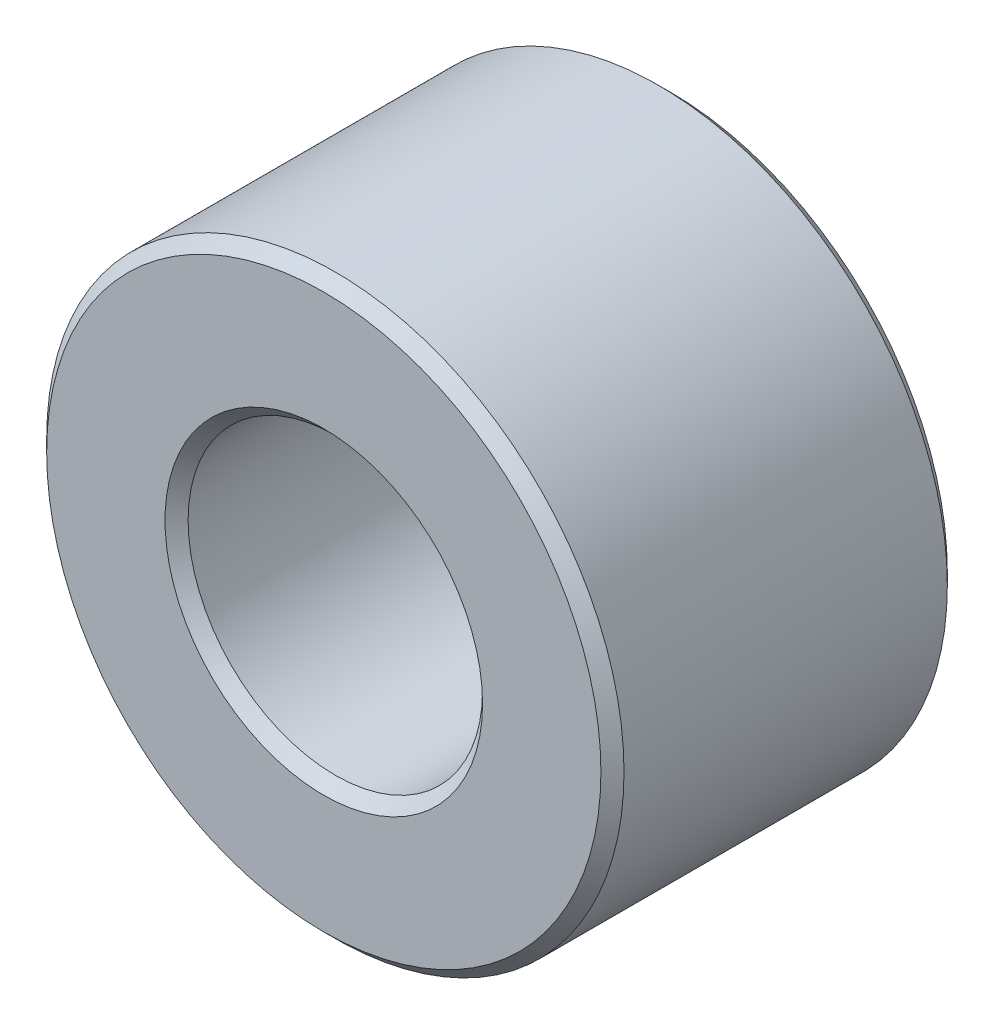
ISO-10303-21;
HEADER;
FILE_DESCRIPTION(('STEP AP214'),'2;1');
FILE_NAME('part.step','',(''),(''),'','','');
FILE_SCHEMA(('AUTOMOTIVE_DESIGN { 1 0 10303 214 1 1 1 1 }'));
ENDSEC;
DATA;
#1=APPLICATION_CONTEXT('core data for automotive mechanical design processes');
#2=APPLICATION_PROTOCOL_DEFINITION('international standard','automotive_design',2000,#1);
#3=PRODUCT_CONTEXT('',#1,'mechanical');
#4=PRODUCT('Part','Part','',(#3));
#5=PRODUCT_RELATED_PRODUCT_CATEGORY('part','',(#4));
#6=PRODUCT_DEFINITION_FORMATION('','',#4);
#7=PRODUCT_DEFINITION_CONTEXT('part definition',#1,'design');
#8=PRODUCT_DEFINITION('design','',#6,#7);
#9=PRODUCT_DEFINITION_SHAPE('','',#8);
#10=(LENGTH_UNIT() NAMED_UNIT(*) SI_UNIT(.MILLI.,.METRE.));
#11=(NAMED_UNIT(*) PLANE_ANGLE_UNIT() SI_UNIT($,.RADIAN.));
#12=(NAMED_UNIT(*) SI_UNIT($,.STERADIAN.) SOLID_ANGLE_UNIT());
#13=UNCERTAINTY_MEASURE_WITH_UNIT(LENGTH_MEASURE(1.E-05),#10,'distance_accuracy_value','');
#14=(GEOMETRIC_REPRESENTATION_CONTEXT(3) GLOBAL_UNCERTAINTY_ASSIGNED_CONTEXT((#13)) GLOBAL_UNIT_ASSIGNED_CONTEXT((#10,
#11,#12)) REPRESENTATION_CONTEXT('',''));
#15=CARTESIAN_POINT('',(0.,0.,0.));
#16=DIRECTION('',(0.,0.,1.));
#17=DIRECTION('',(1.,0.,0.));
#18=AXIS2_PLACEMENT_3D('',#15,#16,#17);
#19=CARTESIAN_POINT('',(0.,0.,6.));
#20=DIRECTION('',(0.,0.,-1.));
#21=DIRECTION('',(-1.,0.,0.));
#22=AXIS2_PLACEMENT_3D('',#19,#20,#21);
#23=CYLINDRICAL_SURFACE('',#22,2.55);
#24=CARTESIAN_POINT('',(0.,0.,0.200000000006639));
#25=DIRECTION('',(0.,0.,-1.));
#26=DIRECTION('',(-1.,0.,0.));
#27=AXIS2_PLACEMENT_3D('',#24,#25,#26);
#28=CIRCLE('',#27,2.54999999992833);
#29=CARTESIAN_POINT('',(-2.54999999992833,0.,0.200000000006639));
#30=VERTEX_POINT('',#29);
#31=EDGE_CURVE('E35',#30,#30,#28,.T.);
#32=ORIENTED_EDGE('',*,*,#31,.T.);
#33=EDGE_LOOP('',(#32));
#34=FACE_BOUND('',#33,.T.);
#35=CARTESIAN_POINT('',(0.,0.,5.80000000007885));
#36=DIRECTION('',(0.,0.,1.));
#37=DIRECTION('',(1.,0.,0.));
#38=AXIS2_PLACEMENT_3D('',#35,#36,#37);
#39=CIRCLE('',#38,2.54999999998518);
#40=CARTESIAN_POINT('',(2.54999999998518,0.,5.80000000007885));
#41=VERTEX_POINT('',#40);
#42=EDGE_CURVE('E32',#41,#41,#39,.T.);
#43=ORIENTED_EDGE('',*,*,#42,.T.);
#44=EDGE_LOOP('',(#43));
#45=FACE_BOUND('',#44,.T.);
#46=ADVANCED_FACE('F15',(#34,#45),#23,.F.);
#47=CARTESIAN_POINT('',(0.,0.,-5.6843418860808E-11));
#48=DIRECTION('',(0.,0.,-1.));
#49=DIRECTION('',(-1.,0.,0.));
#50=AXIS2_PLACEMENT_3D('',#47,#48,#49);
#51=CONICAL_SURFACE('',#50,2.74999999999181,0.785398163397448);
#52=CARTESIAN_POINT('',(0.,0.,-5.6843418860808E-11));
#53=DIRECTION('',(0.,0.,-1.));
#54=DIRECTION('',(-1.,0.,0.));
#55=AXIS2_PLACEMENT_3D('',#52,#53,#54);
#56=CIRCLE('',#55,2.74999999999181);
#57=CARTESIAN_POINT('',(-2.74999999999181,0.,-5.6843418860808E-11));
#58=VERTEX_POINT('',#57);
#59=EDGE_CURVE('E18',#58,#58,#56,.T.);
#60=ORIENTED_EDGE('',*,*,#59,.T.);
#61=EDGE_LOOP('',(#60));
#62=FACE_BOUND('',#61,.T.);
#63=ORIENTED_EDGE('',*,*,#31,.F.);
#64=EDGE_LOOP('',(#63));
#65=FACE_BOUND('',#64,.T.);
#66=ADVANCED_FACE('F49',(#62,#65),#51,.F.);
#67=CARTESIAN_POINT('',(0.,0.,6.00000000002865));
#68=DIRECTION('',(0.,0.,1.));
#69=DIRECTION('',(1.,0.,0.));
#70=AXIS2_PLACEMENT_3D('',#67,#68,#69);
#71=CONICAL_SURFACE('',#70,2.74999999993497,0.785398163397448);
#72=CARTESIAN_POINT('',(0.,0.,6.00000000002865));
#73=DIRECTION('',(0.,0.,1.));
#74=DIRECTION('',(1.,0.,0.));
#75=AXIS2_PLACEMENT_3D('',#72,#73,#74);
#76=CIRCLE('',#75,2.74999999993497);
#77=CARTESIAN_POINT('',(2.74999999993497,0.,6.00000000002865));
#78=VERTEX_POINT('',#77);
#79=EDGE_CURVE('E42',#78,#78,#76,.F.);
#80=ORIENTED_EDGE('',*,*,#79,.F.);
#81=EDGE_LOOP('',(#80));
#82=FACE_BOUND('',#81,.T.);
#83=ORIENTED_EDGE('',*,*,#42,.F.);
#84=EDGE_LOOP('',(#83));
#85=FACE_BOUND('',#84,.T.);
#86=ADVANCED_FACE('F56',(#82,#85),#71,.F.);
#87=CARTESIAN_POINT('',(0.,0.,0.));
#88=DIRECTION('',(0.,0.,1.));
#89=DIRECTION('',(1.,0.,0.));
#90=AXIS2_PLACEMENT_3D('',#87,#88,#89);
#91=PLANE('',#90);
#92=ORIENTED_EDGE('',*,*,#59,.F.);
#93=EDGE_LOOP('',(#92));
#94=FACE_BOUND('',#93,.T.);
#95=CARTESIAN_POINT('',(0.,0.,0.));
#96=DIRECTION('',(0.,0.,1.));
#97=DIRECTION('',(1.,0.,0.));
#98=AXIS2_PLACEMENT_3D('',#95,#96,#97);
#99=CIRCLE('',#98,4.79999999998881);
#100=CARTESIAN_POINT('',(4.79999999998881,0.,0.));
#101=VERTEX_POINT('',#100);
#102=EDGE_CURVE('E40',#101,#101,#99,.T.);
#103=ORIENTED_EDGE('',*,*,#102,.F.);
#104=EDGE_LOOP('',(#103));
#105=FACE_BOUND('',#104,.T.);
#106=ADVANCED_FACE('F52',(#94,#105),#91,.F.);
#107=CARTESIAN_POINT('',(0.,0.,6.));
#108=DIRECTION('',(0.,0.,1.));
#109=DIRECTION('',(1.,0.,0.));
#110=AXIS2_PLACEMENT_3D('',#107,#108,#109);
#111=PLANE('',#110);
#112=ORIENTED_EDGE('',*,*,#79,.T.);
#113=EDGE_LOOP('',(#112));
#114=FACE_BOUND('',#113,.T.);
#115=CARTESIAN_POINT('',(0.,0.,6.00000000002865));
#116=DIRECTION('',(0.,0.,-1.));
#117=DIRECTION('',(-1.,0.,0.));
#118=AXIS2_PLACEMENT_3D('',#115,#116,#117);
#119=CIRCLE('',#118,4.79999999993197);
#120=CARTESIAN_POINT('',(-4.79999999993197,0.,6.00000000002865));
#121=VERTEX_POINT('',#120);
#122=EDGE_CURVE('E27',#121,#121,#119,.T.);
#123=ORIENTED_EDGE('',*,*,#122,.F.);
#124=EDGE_LOOP('',(#123));
#125=FACE_BOUND('',#124,.T.);
#126=ADVANCED_FACE('F55',(#114,#125),#111,.T.);
#127=CARTESIAN_POINT('',(0.,0.,0.199999999836109));
#128=DIRECTION('',(0.,0.,1.));
#129=DIRECTION('',(1.,0.,0.));
#130=AXIS2_PLACEMENT_3D('',#127,#128,#129);
#131=CONICAL_SURFACE('',#130,4.99999999982492,0.785398163397448);
#132=ORIENTED_EDGE('',*,*,#102,.T.);
#133=EDGE_LOOP('',(#132));
#134=FACE_BOUND('',#133,.T.);
#135=CARTESIAN_POINT('',(0.,0.,0.199999999999998));
#136=DIRECTION('',(0.,0.,-1.));
#137=DIRECTION('',(-1.,0.,0.));
#138=AXIS2_PLACEMENT_3D('',#135,#136,#137);
#139=CIRCLE('',#138,5.);
#140=CARTESIAN_POINT('',(-5.,0.,0.199999999999998));
#141=VERTEX_POINT('',#140);
#142=EDGE_CURVE('E22',#141,#141,#139,.F.);
#143=ORIENTED_EDGE('',*,*,#142,.F.);
#144=EDGE_LOOP('',(#143));
#145=FACE_BOUND('',#144,.T.);
#146=ADVANCED_FACE('F60',(#134,#145),#131,.T.);
#147=CARTESIAN_POINT('',(0.,0.,5.80000000007885));
#148=DIRECTION('',(0.,0.,-1.));
#149=DIRECTION('',(-1.,0.,0.));
#150=AXIS2_PLACEMENT_3D('',#147,#148,#149);
#151=CONICAL_SURFACE('',#150,4.99999999988177,0.785398163397448);
#152=ORIENTED_EDGE('',*,*,#122,.T.);
#153=EDGE_LOOP('',(#152));
#154=FACE_BOUND('',#153,.T.);
#155=CARTESIAN_POINT('',(0.,0.,5.8));
#156=DIRECTION('',(0.,0.,-1.));
#157=DIRECTION('',(-1.,0.,0.));
#158=AXIS2_PLACEMENT_3D('',#155,#156,#157);
#159=CIRCLE('',#158,5.);
#160=CARTESIAN_POINT('',(-5.,0.,5.8));
#161=VERTEX_POINT('',#160);
#162=EDGE_CURVE('E10',#161,#161,#159,.T.);
#163=ORIENTED_EDGE('',*,*,#162,.F.);
#164=EDGE_LOOP('',(#163));
#165=FACE_BOUND('',#164,.T.);
#166=ADVANCED_FACE('F63',(#154,#165),#151,.T.);
#167=CARTESIAN_POINT('',(0.,0.,6.));
#168=DIRECTION('',(0.,0.,-1.));
#169=DIRECTION('',(-1.,0.,0.));
#170=AXIS2_PLACEMENT_3D('',#167,#168,#169);
#171=CYLINDRICAL_SURFACE('',#170,5.);
#172=ORIENTED_EDGE('',*,*,#162,.T.);
#173=EDGE_LOOP('',(#172));
#174=FACE_BOUND('',#173,.T.);
#175=ORIENTED_EDGE('',*,*,#142,.T.);
#176=EDGE_LOOP('',(#175));
#177=FACE_BOUND('',#176,.T.);
#178=ADVANCED_FACE('F67',(#174,#177),#171,.T.);
#179=CLOSED_SHELL('',(#46,#66,#86,#106,#126,#146,#166,#178));
#180=MANIFOLD_SOLID_BREP('B1',#179);
#181=ADVANCED_BREP_SHAPE_REPRESENTATION('',(#18,#180),#14);
#182=SHAPE_DEFINITION_REPRESENTATION(#9,#181);
ENDSEC;
END-ISO-10303-21;
